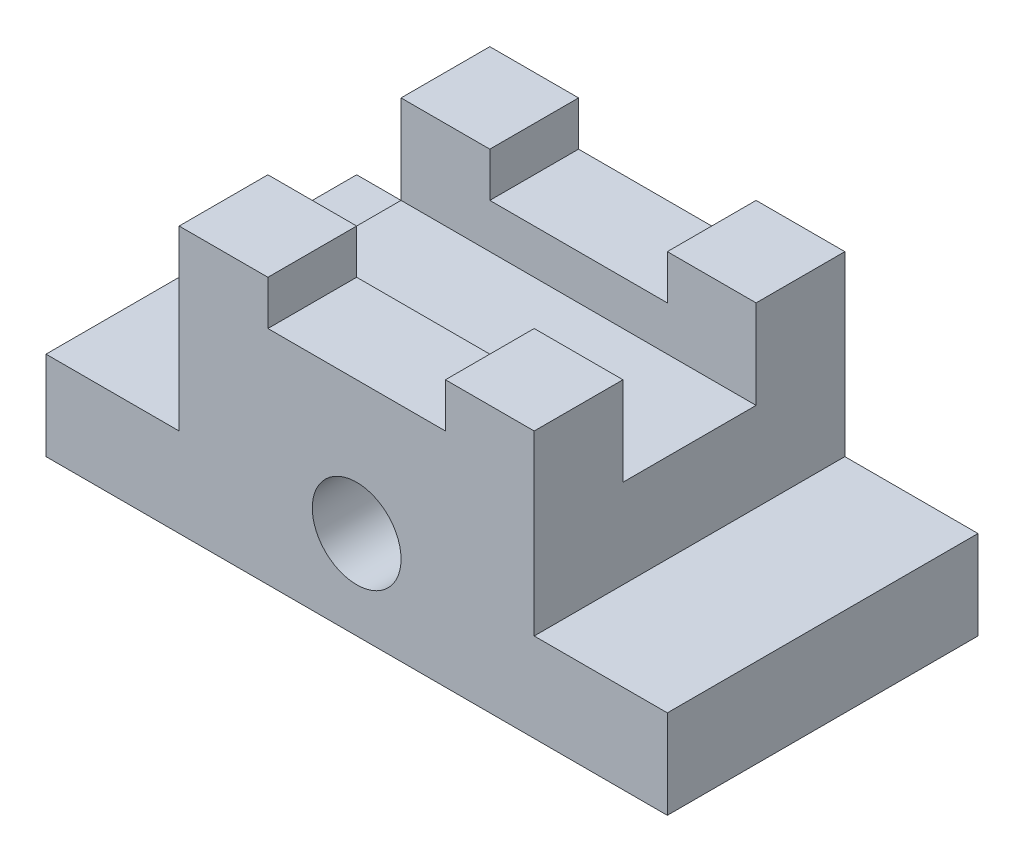
ISO-10303-21;
HEADER;
FILE_DESCRIPTION(('STEP AP214'),'2;1');
FILE_NAME('part.step','',(''),(''),'','','');
FILE_SCHEMA(('AUTOMOTIVE_DESIGN { 1 0 10303 214 1 1 1 1 }'));
ENDSEC;
DATA;
#1=APPLICATION_CONTEXT('core data for automotive mechanical design processes');
#2=APPLICATION_PROTOCOL_DEFINITION('international standard','automotive_design',2000,#1);
#3=PRODUCT_CONTEXT('',#1,'mechanical');
#4=PRODUCT('Part','Part','',(#3));
#5=PRODUCT_RELATED_PRODUCT_CATEGORY('part','',(#4));
#6=PRODUCT_DEFINITION_FORMATION('','',#4);
#7=PRODUCT_DEFINITION_CONTEXT('part definition',#1,'design');
#8=PRODUCT_DEFINITION('design','',#6,#7);
#9=PRODUCT_DEFINITION_SHAPE('','',#8);
#10=(LENGTH_UNIT() NAMED_UNIT(*) SI_UNIT(.MILLI.,.METRE.));
#11=(NAMED_UNIT(*) PLANE_ANGLE_UNIT() SI_UNIT($,.RADIAN.));
#12=(NAMED_UNIT(*) SI_UNIT($,.STERADIAN.) SOLID_ANGLE_UNIT());
#13=UNCERTAINTY_MEASURE_WITH_UNIT(LENGTH_MEASURE(1.E-05),#10,'distance_accuracy_value','');
#14=(GEOMETRIC_REPRESENTATION_CONTEXT(3) GLOBAL_UNCERTAINTY_ASSIGNED_CONTEXT((#13)) GLOBAL_UNIT_ASSIGNED_CONTEXT((#10,
#11,#12)) REPRESENTATION_CONTEXT('',''));
#15=CARTESIAN_POINT('',(0.,0.,0.));
#16=DIRECTION('',(0.,0.,1.));
#17=DIRECTION('',(1.,0.,0.));
#18=AXIS2_PLACEMENT_3D('',#15,#16,#17);
#19=CARTESIAN_POINT('',(0.,30.,0.));
#20=DIRECTION('',(0.,-1.,0.));
#21=DIRECTION('',(0.,0.,-1.));
#22=AXIS2_PLACEMENT_3D('',#19,#20,#21);
#23=PLANE('',#22);
#24=DIRECTION('',(1.,0.,0.));
#25=VECTOR('',#24,1.);
#26=CARTESIAN_POINT('',(14.,30.,-25.));
#27=LINE('',#26,#25);
#28=CARTESIAN_POINT('',(15.,30.,-25.));
#29=VERTEX_POINT('',#28);
#30=CARTESIAN_POINT('',(25.,30.,-25.));
#31=VERTEX_POINT('',#30);
#32=EDGE_CURVE('E266',#29,#31,#27,.T.);
#33=ORIENTED_EDGE('',*,*,#32,.T.);
#34=DIRECTION('',(0.,0.,1.));
#35=VECTOR('',#34,1.);
#36=CARTESIAN_POINT('',(25.,30.,-41.));
#37=LINE('',#36,#35);
#38=CARTESIAN_POINT('',(25.,30.,-35.));
#39=VERTEX_POINT('',#38);
#40=EDGE_CURVE('E208',#39,#31,#37,.T.);
#41=ORIENTED_EDGE('',*,*,#40,.F.);
#42=DIRECTION('',(-1.,0.,0.));
#43=VECTOR('',#42,1.);
#44=CARTESIAN_POINT('',(0.,30.,-35.));
#45=LINE('',#44,#43);
#46=CARTESIAN_POINT('',(15.,30.,-35.));
#47=VERTEX_POINT('',#46);
#48=EDGE_CURVE('E337',#39,#47,#45,.T.);
#49=ORIENTED_EDGE('',*,*,#48,.T.);
#50=DIRECTION('',(0.,0.,-1.));
#51=VECTOR('',#50,1.);
#52=CARTESIAN_POINT('',(15.,30.,0.));
#53=LINE('',#52,#51);
#54=EDGE_CURVE('E305',#29,#47,#53,.T.);
#55=ORIENTED_EDGE('',*,*,#54,.F.);
#56=EDGE_LOOP('',(#33,#41,#49,#55));
#57=FACE_BOUND('',#56,.T.);
#58=ADVANCED_FACE('F39',(#57),#23,.F.);
#59=DIRECTION('',(1.,0.,0.));
#60=VECTOR('',#59,1.);
#61=CARTESIAN_POINT('',(0.,30.,0.));
#62=LINE('',#61,#60);
#63=CARTESIAN_POINT('',(15.,30.,0.));
#64=VERTEX_POINT('',#63);
#65=CARTESIAN_POINT('',(25.,30.,0.));
#66=VERTEX_POINT('',#65);
#67=EDGE_CURVE('E334',#64,#66,#62,.T.);
#68=ORIENTED_EDGE('',*,*,#67,.T.);
#69=CARTESIAN_POINT('',(25.,30.,-10.));
#70=VERTEX_POINT('',#69);
#71=EDGE_CURVE('E191',#70,#66,#37,.T.);
#72=ORIENTED_EDGE('',*,*,#71,.F.);
#73=DIRECTION('',(1.,0.,0.));
#74=VECTOR('',#73,1.);
#75=CARTESIAN_POINT('',(14.,30.,-9.99999999999999));
#76=LINE('',#75,#74);
#77=CARTESIAN_POINT('',(15.,30.,-9.99999999999999));
#78=VERTEX_POINT('',#77);
#79=EDGE_CURVE('E261',#78,#70,#76,.T.);
#80=ORIENTED_EDGE('',*,*,#79,.F.);
#81=EDGE_CURVE('E312',#64,#78,#53,.T.);
#82=ORIENTED_EDGE('',*,*,#81,.F.);
#83=EDGE_LOOP('',(#68,#72,#80,#82));
#84=FACE_BOUND('',#83,.T.);
#85=ADVANCED_FACE('F440',(#84),#23,.F.);
#86=CARTESIAN_POINT('',(55.,30.,-35.));
#87=VERTEX_POINT('',#86);
#88=CARTESIAN_POINT('',(45.,30.,-35.));
#89=VERTEX_POINT('',#88);
#90=EDGE_CURVE('E339',#87,#89,#45,.T.);
#91=ORIENTED_EDGE('',*,*,#90,.T.);
#92=DIRECTION('',(0.,0.,1.));
#93=VECTOR('',#92,1.);
#94=CARTESIAN_POINT('',(45.,30.,-41.));
#95=LINE('',#94,#93);
#96=CARTESIAN_POINT('',(45.,30.,-25.));
#97=VERTEX_POINT('',#96);
#98=EDGE_CURVE('E209',#89,#97,#95,.T.);
#99=ORIENTED_EDGE('',*,*,#98,.T.);
#100=CARTESIAN_POINT('',(55.,30.,-25.));
#101=VERTEX_POINT('',#100);
#102=EDGE_CURVE('E253',#97,#101,#27,.T.);
#103=ORIENTED_EDGE('',*,*,#102,.T.);
#104=DIRECTION('',(0.,0.,1.));
#105=VECTOR('',#104,1.);
#106=CARTESIAN_POINT('',(55.,30.,-35.));
#107=LINE('',#106,#105);
#108=EDGE_CURVE('E286',#87,#101,#107,.T.);
#109=ORIENTED_EDGE('',*,*,#108,.F.);
#110=EDGE_LOOP('',(#91,#99,#103,#109));
#111=FACE_BOUND('',#110,.T.);
#112=ADVANCED_FACE('F399',(#111),#23,.F.);
#113=CARTESIAN_POINT('',(0.,30.,0.));
#114=DIRECTION('',(1.,0.,0.));
#115=DIRECTION('',(0.,0.,-1.));
#116=AXIS2_PLACEMENT_3D('',#113,#114,#115);
#117=PLANE('',#116);
#118=DIRECTION('',(0.,-1.,0.));
#119=VECTOR('',#118,1.);
#120=CARTESIAN_POINT('',(0.,30.,0.));
#121=LINE('',#120,#119);
#122=CARTESIAN_POINT('',(0.,10.,0.));
#123=VERTEX_POINT('',#122);
#124=CARTESIAN_POINT('',(0.,0.,0.));
#125=VERTEX_POINT('',#124);
#126=EDGE_CURVE('E367',#123,#125,#121,.T.);
#127=ORIENTED_EDGE('',*,*,#126,.F.);
#128=DIRECTION('',(0.,0.,1.));
#129=VECTOR('',#128,1.);
#130=CARTESIAN_POINT('',(0.,10.,0.));
#131=LINE('',#130,#129);
#132=CARTESIAN_POINT('',(0.,10.,-35.));
#133=VERTEX_POINT('',#132);
#134=EDGE_CURVE('E308',#133,#123,#131,.T.);
#135=ORIENTED_EDGE('',*,*,#134,.F.);
#136=DIRECTION('',(0.,-1.,0.));
#137=VECTOR('',#136,1.);
#138=CARTESIAN_POINT('',(0.,30.,-35.));
#139=LINE('',#138,#137);
#140=CARTESIAN_POINT('',(0.,0.,-35.));
#141=VERTEX_POINT('',#140);
#142=EDGE_CURVE('E343',#133,#141,#139,.T.);
#143=ORIENTED_EDGE('',*,*,#142,.T.);
#144=DIRECTION('',(0.,0.,1.));
#145=VECTOR('',#144,1.);
#146=CARTESIAN_POINT('',(0.,0.,0.));
#147=LINE('',#146,#145);
#148=EDGE_CURVE('E331',#141,#125,#147,.T.);
#149=ORIENTED_EDGE('',*,*,#148,.T.);
#150=EDGE_LOOP('',(#127,#135,#143,#149));
#151=FACE_BOUND('',#150,.T.);
#152=ADVANCED_FACE('F41',(#151),#117,.F.);
#153=CARTESIAN_POINT('',(0.,30.,0.));
#154=DIRECTION('',(0.,0.,-1.));
#155=DIRECTION('',(-1.,0.,0.));
#156=AXIS2_PLACEMENT_3D('',#153,#154,#155);
#157=PLANE('',#156);
#158=CARTESIAN_POINT('',(35.,10.,0.));
#159=DIRECTION('',(0.,0.,1.));
#160=DIRECTION('',(1.,0.,0.));
#161=AXIS2_PLACEMENT_3D('',#158,#159,#160);
#162=CIRCLE('',#161,5.);
#163=CARTESIAN_POINT('',(40.,10.,0.));
#164=VERTEX_POINT('',#163);
#165=EDGE_CURVE('E493',#164,#164,#162,.T.);
#166=ORIENTED_EDGE('',*,*,#165,.F.);
#167=EDGE_LOOP('',(#166));
#168=FACE_BOUND('',#167,.T.);
#169=DIRECTION('',(1.,0.,0.));
#170=VECTOR('',#169,1.);
#171=CARTESIAN_POINT('',(25.,25.,0.));
#172=LINE('',#171,#170);
#173=CARTESIAN_POINT('',(25.,25.,0.));
#174=VERTEX_POINT('',#173);
#175=CARTESIAN_POINT('',(45.,25.,0.));
#176=VERTEX_POINT('',#175);
#177=EDGE_CURVE('E179',#174,#176,#172,.T.);
#178=ORIENTED_EDGE('',*,*,#177,.F.);
#179=DIRECTION('',(0.,-1.,0.));
#180=VECTOR('',#179,1.);
#181=CARTESIAN_POINT('',(25.,30.,0.));
#182=LINE('',#181,#180);
#183=EDGE_CURVE('E188',#66,#174,#182,.T.);
#184=ORIENTED_EDGE('',*,*,#183,.F.);
#185=ORIENTED_EDGE('',*,*,#67,.F.);
#186=DIRECTION('',(0.,1.,0.));
#187=VECTOR('',#186,1.);
#188=CARTESIAN_POINT('',(15.,10.,0.));
#189=LINE('',#188,#187);
#190=CARTESIAN_POINT('',(15.,10.,0.));
#191=VERTEX_POINT('',#190);
#192=EDGE_CURVE('E323',#191,#64,#189,.T.);
#193=ORIENTED_EDGE('',*,*,#192,.F.);
#194=DIRECTION('',(1.,0.,0.));
#195=VECTOR('',#194,1.);
#196=CARTESIAN_POINT('',(0.,10.,0.));
#197=LINE('',#196,#195);
#198=EDGE_CURVE('E311',#123,#191,#197,.T.);
#199=ORIENTED_EDGE('',*,*,#198,.F.);
#200=ORIENTED_EDGE('',*,*,#126,.T.);
#201=DIRECTION('',(1.,0.,0.));
#202=VECTOR('',#201,1.);
#203=CARTESIAN_POINT('',(0.,0.,0.));
#204=LINE('',#203,#202);
#205=CARTESIAN_POINT('',(70.,0.,0.));
#206=VERTEX_POINT('',#205);
#207=EDGE_CURVE('E347',#125,#206,#204,.T.);
#208=ORIENTED_EDGE('',*,*,#207,.T.);
#209=DIRECTION('',(0.,-1.,0.));
#210=VECTOR('',#209,1.);
#211=CARTESIAN_POINT('',(70.,30.,0.));
#212=LINE('',#211,#210);
#213=CARTESIAN_POINT('',(70.,10.,0.));
#214=VERTEX_POINT('',#213);
#215=EDGE_CURVE('E364',#214,#206,#212,.T.);
#216=ORIENTED_EDGE('',*,*,#215,.F.);
#217=DIRECTION('',(1.,0.,0.));
#218=VECTOR('',#217,1.);
#219=CARTESIAN_POINT('',(70.,10.,0.));
#220=LINE('',#219,#218);
#221=CARTESIAN_POINT('',(55.,10.,0.));
#222=VERTEX_POINT('',#221);
#223=EDGE_CURVE('E294',#222,#214,#220,.T.);
#224=ORIENTED_EDGE('',*,*,#223,.F.);
#225=DIRECTION('',(0.,1.,0.));
#226=VECTOR('',#225,1.);
#227=CARTESIAN_POINT('',(55.,10.,0.));
#228=LINE('',#227,#226);
#229=CARTESIAN_POINT('',(55.,30.,0.));
#230=VERTEX_POINT('',#229);
#231=EDGE_CURVE('E301',#222,#230,#228,.T.);
#232=ORIENTED_EDGE('',*,*,#231,.T.);
#233=CARTESIAN_POINT('',(45.,30.,0.));
#234=VERTEX_POINT('',#233);
#235=EDGE_CURVE('E338',#234,#230,#62,.T.);
#236=ORIENTED_EDGE('',*,*,#235,.F.);
#237=DIRECTION('',(0.,1.,0.));
#238=VECTOR('',#237,1.);
#239=CARTESIAN_POINT('',(45.,30.,0.));
#240=LINE('',#239,#238);
#241=EDGE_CURVE('E185',#176,#234,#240,.T.);
#242=ORIENTED_EDGE('',*,*,#241,.F.);
#243=EDGE_LOOP('',(#178,#184,#185,#193,#199,#200,#208,#216,#224,#232,#236,#242));
#244=FACE_BOUND('',#243,.T.);
#245=ADVANCED_FACE('F198',(#168,#244),#157,.F.);
#246=CARTESIAN_POINT('',(70.,30.,0.));
#247=DIRECTION('',(-1.,0.,0.));
#248=DIRECTION('',(0.,0.,1.));
#249=AXIS2_PLACEMENT_3D('',#246,#247,#248);
#250=PLANE('',#249);
#251=DIRECTION('',(0.,-1.,0.));
#252=VECTOR('',#251,1.);
#253=CARTESIAN_POINT('',(70.,30.,-35.));
#254=LINE('',#253,#252);
#255=CARTESIAN_POINT('',(70.,10.,-35.));
#256=VERTEX_POINT('',#255);
#257=CARTESIAN_POINT('',(70.,0.,-35.));
#258=VERTEX_POINT('',#257);
#259=EDGE_CURVE('E361',#256,#258,#254,.T.);
#260=ORIENTED_EDGE('',*,*,#259,.F.);
#261=DIRECTION('',(0.,0.,-1.));
#262=VECTOR('',#261,1.);
#263=CARTESIAN_POINT('',(70.,10.,-35.));
#264=LINE('',#263,#262);
#265=EDGE_CURVE('E282',#214,#256,#264,.T.);
#266=ORIENTED_EDGE('',*,*,#265,.F.);
#267=ORIENTED_EDGE('',*,*,#215,.T.);
#268=DIRECTION('',(0.,0.,-1.));
#269=VECTOR('',#268,1.);
#270=CARTESIAN_POINT('',(70.,0.,0.));
#271=LINE('',#270,#269);
#272=EDGE_CURVE('E351',#206,#258,#271,.T.);
#273=ORIENTED_EDGE('',*,*,#272,.T.);
#274=EDGE_LOOP('',(#260,#266,#267,#273));
#275=FACE_BOUND('',#274,.T.);
#276=ADVANCED_FACE('F426',(#275),#250,.F.);
#277=CARTESIAN_POINT('',(0.,30.,-35.));
#278=DIRECTION('',(0.,0.,1.));
#279=DIRECTION('',(1.,0.,0.));
#280=AXIS2_PLACEMENT_3D('',#277,#278,#279);
#281=PLANE('',#280);
#282=CARTESIAN_POINT('',(35.,10.,-35.));
#283=DIRECTION('',(0.,0.,1.));
#284=DIRECTION('',(1.,0.,0.));
#285=AXIS2_PLACEMENT_3D('',#282,#283,#284);
#286=CIRCLE('',#285,5.);
#287=CARTESIAN_POINT('',(40.,10.,-35.));
#288=VERTEX_POINT('',#287);
#289=EDGE_CURVE('E196',#288,#288,#286,.T.);
#290=ORIENTED_EDGE('',*,*,#289,.T.);
#291=EDGE_LOOP('',(#290));
#292=FACE_BOUND('',#291,.T.);
#293=ORIENTED_EDGE('',*,*,#48,.F.);
#294=DIRECTION('',(0.,-1.,0.));
#295=VECTOR('',#294,1.);
#296=CARTESIAN_POINT('',(25.,30.,-35.));
#297=LINE('',#296,#295);
#298=CARTESIAN_POINT('',(25.,25.,-35.));
#299=VERTEX_POINT('',#298);
#300=EDGE_CURVE('E237',#39,#299,#297,.T.);
#301=ORIENTED_EDGE('',*,*,#300,.T.);
#302=DIRECTION('',(1.,0.,0.));
#303=VECTOR('',#302,1.);
#304=CARTESIAN_POINT('',(0.,25.,-35.));
#305=LINE('',#304,#303);
#306=CARTESIAN_POINT('',(45.,25.,-35.));
#307=VERTEX_POINT('',#306);
#308=EDGE_CURVE('E221',#299,#307,#305,.T.);
#309=ORIENTED_EDGE('',*,*,#308,.T.);
#310=DIRECTION('',(0.,1.,0.));
#311=VECTOR('',#310,1.);
#312=CARTESIAN_POINT('',(45.,30.0000000000001,-35.));
#313=LINE('',#312,#311);
#314=EDGE_CURVE('E229',#307,#89,#313,.T.);
#315=ORIENTED_EDGE('',*,*,#314,.T.);
#316=ORIENTED_EDGE('',*,*,#90,.F.);
#317=DIRECTION('',(0.,1.,0.));
#318=VECTOR('',#317,1.);
#319=CARTESIAN_POINT('',(55.,10.,-35.));
#320=LINE('',#319,#318);
#321=CARTESIAN_POINT('',(55.,10.,-35.));
#322=VERTEX_POINT('',#321);
#323=EDGE_CURVE('E297',#322,#87,#320,.T.);
#324=ORIENTED_EDGE('',*,*,#323,.F.);
#325=DIRECTION('',(-1.,0.,0.));
#326=VECTOR('',#325,1.);
#327=CARTESIAN_POINT('',(70.,10.,-35.));
#328=LINE('',#327,#326);
#329=EDGE_CURVE('E285',#256,#322,#328,.T.);
#330=ORIENTED_EDGE('',*,*,#329,.F.);
#331=ORIENTED_EDGE('',*,*,#259,.T.);
#332=DIRECTION('',(-1.,0.,0.));
#333=VECTOR('',#332,1.);
#334=CARTESIAN_POINT('',(0.,0.,-35.));
#335=LINE('',#334,#333);
#336=EDGE_CURVE('E355',#258,#141,#335,.T.);
#337=ORIENTED_EDGE('',*,*,#336,.T.);
#338=ORIENTED_EDGE('',*,*,#142,.F.);
#339=DIRECTION('',(-1.,0.,0.));
#340=VECTOR('',#339,1.);
#341=CARTESIAN_POINT('',(0.,10.,-35.));
#342=LINE('',#341,#340);
#343=CARTESIAN_POINT('',(15.,10.,-35.));
#344=VERTEX_POINT('',#343);
#345=EDGE_CURVE('E320',#344,#133,#342,.T.);
#346=ORIENTED_EDGE('',*,*,#345,.F.);
#347=DIRECTION('',(0.,1.,0.));
#348=VECTOR('',#347,1.);
#349=CARTESIAN_POINT('',(15.,10.,-35.));
#350=LINE('',#349,#348);
#351=EDGE_CURVE('E327',#344,#47,#350,.T.);
#352=ORIENTED_EDGE('',*,*,#351,.T.);
#353=EDGE_LOOP('',(#293,#301,#309,#315,#316,#324,#330,#331,#337,#338,#346,#352));
#354=FACE_BOUND('',#353,.T.);
#355=ADVANCED_FACE('F403',(#292,#354),#281,.F.);
#356=CARTESIAN_POINT('',(45.,30.,-10.));
#357=VERTEX_POINT('',#356);
#358=CARTESIAN_POINT('',(55.,30.,-9.99999999999999));
#359=VERTEX_POINT('',#358);
#360=EDGE_CURVE('E265',#357,#359,#76,.T.);
#361=ORIENTED_EDGE('',*,*,#360,.F.);
#362=EDGE_CURVE('E210',#357,#234,#95,.T.);
#363=ORIENTED_EDGE('',*,*,#362,.T.);
#364=ORIENTED_EDGE('',*,*,#235,.T.);
#365=EDGE_CURVE('E281',#359,#230,#107,.T.);
#366=ORIENTED_EDGE('',*,*,#365,.F.);
#367=EDGE_LOOP('',(#361,#363,#364,#366));
#368=FACE_BOUND('',#367,.T.);
#369=ADVANCED_FACE('F380',(#368),#23,.F.);
#370=CARTESIAN_POINT('',(0.,0.,0.));
#371=DIRECTION('',(0.,-1.,0.));
#372=DIRECTION('',(0.,0.,-1.));
#373=AXIS2_PLACEMENT_3D('',#370,#371,#372);
#374=PLANE('',#373);
#375=ORIENTED_EDGE('',*,*,#148,.F.);
#376=ORIENTED_EDGE('',*,*,#336,.F.);
#377=ORIENTED_EDGE('',*,*,#272,.F.);
#378=ORIENTED_EDGE('',*,*,#207,.F.);
#379=EDGE_LOOP('',(#375,#376,#377,#378));
#380=FACE_BOUND('',#379,.T.);
#381=ADVANCED_FACE('F448',(#380),#374,.T.);
#382=CARTESIAN_POINT('',(15.,10.,0.));
#383=DIRECTION('',(1.,0.,0.));
#384=DIRECTION('',(0.,0.,-1.));
#385=AXIS2_PLACEMENT_3D('',#382,#383,#384);
#386=PLANE('',#385);
#387=DIRECTION('',(0.,0.,-1.));
#388=VECTOR('',#387,1.);
#389=CARTESIAN_POINT('',(15.,20.,0.));
#390=LINE('',#389,#388);
#391=CARTESIAN_POINT('',(15.,20.,-9.99999999999999));
#392=VERTEX_POINT('',#391);
#393=CARTESIAN_POINT('',(15.,20.,-25.));
#394=VERTEX_POINT('',#393);
#395=EDGE_CURVE('E273',#392,#394,#390,.T.);
#396=ORIENTED_EDGE('',*,*,#395,.T.);
#397=DIRECTION('',(0.,1.,0.));
#398=VECTOR('',#397,1.);
#399=CARTESIAN_POINT('',(15.,10.,-25.));
#400=LINE('',#399,#398);
#401=EDGE_CURVE('E277',#394,#29,#400,.T.);
#402=ORIENTED_EDGE('',*,*,#401,.T.);
#403=ORIENTED_EDGE('',*,*,#54,.T.);
#404=ORIENTED_EDGE('',*,*,#351,.F.);
#405=DIRECTION('',(0.,0.,-1.));
#406=VECTOR('',#405,1.);
#407=CARTESIAN_POINT('',(15.,10.,0.));
#408=LINE('',#407,#406);
#409=EDGE_CURVE('E316',#191,#344,#408,.T.);
#410=ORIENTED_EDGE('',*,*,#409,.F.);
#411=ORIENTED_EDGE('',*,*,#192,.T.);
#412=ORIENTED_EDGE('',*,*,#81,.T.);
#413=DIRECTION('',(0.,-1.,0.));
#414=VECTOR('',#413,1.);
#415=CARTESIAN_POINT('',(15.,10.,-9.99999999999999));
#416=LINE('',#415,#414);
#417=EDGE_CURVE('E257',#78,#392,#416,.T.);
#418=ORIENTED_EDGE('',*,*,#417,.T.);
#419=EDGE_LOOP('',(#396,#402,#403,#404,#410,#411,#412,#418));
#420=FACE_BOUND('',#419,.T.);
#421=ADVANCED_FACE('F436',(#420),#386,.F.);
#422=CARTESIAN_POINT('',(0.,10.,0.));
#423=DIRECTION('',(0.,-1.,0.));
#424=DIRECTION('',(0.,0.,-1.));
#425=AXIS2_PLACEMENT_3D('',#422,#423,#424);
#426=PLANE('',#425);
#427=ORIENTED_EDGE('',*,*,#134,.T.);
#428=ORIENTED_EDGE('',*,*,#198,.T.);
#429=ORIENTED_EDGE('',*,*,#409,.T.);
#430=ORIENTED_EDGE('',*,*,#345,.T.);
#431=EDGE_LOOP('',(#427,#428,#429,#430));
#432=FACE_BOUND('',#431,.T.);
#433=ADVANCED_FACE('F455',(#432),#426,.F.);
#434=CARTESIAN_POINT('',(55.,10.,-35.));
#435=DIRECTION('',(-1.,0.,0.));
#436=DIRECTION('',(0.,0.,1.));
#437=AXIS2_PLACEMENT_3D('',#434,#435,#436);
#438=PLANE('',#437);
#439=ORIENTED_EDGE('',*,*,#108,.T.);
#440=DIRECTION('',(0.,1.,0.));
#441=VECTOR('',#440,1.);
#442=CARTESIAN_POINT('',(55.,30.,-25.));
#443=LINE('',#442,#441);
#444=CARTESIAN_POINT('',(55.,20.,-25.));
#445=VERTEX_POINT('',#444);
#446=EDGE_CURVE('E241',#445,#101,#443,.T.);
#447=ORIENTED_EDGE('',*,*,#446,.F.);
#448=DIRECTION('',(0.,0.,-1.));
#449=VECTOR('',#448,1.);
#450=CARTESIAN_POINT('',(55.,20.,-25.));
#451=LINE('',#450,#449);
#452=CARTESIAN_POINT('',(55.,20.,-10.));
#453=VERTEX_POINT('',#452);
#454=EDGE_CURVE('E249',#453,#445,#451,.T.);
#455=ORIENTED_EDGE('',*,*,#454,.F.);
#456=DIRECTION('',(0.,-1.,0.));
#457=VECTOR('',#456,1.);
#458=CARTESIAN_POINT('',(55.,30.,-10.));
#459=LINE('',#458,#457);
#460=EDGE_CURVE('E245',#359,#453,#459,.T.);
#461=ORIENTED_EDGE('',*,*,#460,.F.);
#462=ORIENTED_EDGE('',*,*,#365,.T.);
#463=ORIENTED_EDGE('',*,*,#231,.F.);
#464=DIRECTION('',(0.,0.,1.));
#465=VECTOR('',#464,1.);
#466=CARTESIAN_POINT('',(55.,10.,-35.));
#467=LINE('',#466,#465);
#468=EDGE_CURVE('E290',#322,#222,#467,.T.);
#469=ORIENTED_EDGE('',*,*,#468,.F.);
#470=ORIENTED_EDGE('',*,*,#323,.T.);
#471=EDGE_LOOP('',(#439,#447,#455,#461,#462,#463,#469,#470));
#472=FACE_BOUND('',#471,.T.);
#473=ADVANCED_FACE('F416',(#472),#438,.F.);
#474=CARTESIAN_POINT('',(0.,10.,0.));
#475=DIRECTION('',(0.,-1.,0.));
#476=DIRECTION('',(0.,0.,-1.));
#477=AXIS2_PLACEMENT_3D('',#474,#475,#476);
#478=PLANE('',#477);
#479=ORIENTED_EDGE('',*,*,#265,.T.);
#480=ORIENTED_EDGE('',*,*,#329,.T.);
#481=ORIENTED_EDGE('',*,*,#468,.T.);
#482=ORIENTED_EDGE('',*,*,#223,.T.);
#483=EDGE_LOOP('',(#479,#480,#481,#482));
#484=FACE_BOUND('',#483,.T.);
#485=ADVANCED_FACE('F422',(#484),#478,.F.);
#486=CARTESIAN_POINT('',(14.,30.,-25.));
#487=DIRECTION('',(0.,0.,-1.));
#488=DIRECTION('',(-1.,0.,0.));
#489=AXIS2_PLACEMENT_3D('',#486,#487,#488);
#490=PLANE('',#489);
#491=DIRECTION('',(-1.,0.,0.));
#492=VECTOR('',#491,1.);
#493=CARTESIAN_POINT('',(14.,25.,-25.));
#494=LINE('',#493,#492);
#495=CARTESIAN_POINT('',(45.,25.,-25.));
#496=VERTEX_POINT('',#495);
#497=CARTESIAN_POINT('',(25.,25.,-25.));
#498=VERTEX_POINT('',#497);
#499=EDGE_CURVE('E217',#496,#498,#494,.T.);
#500=ORIENTED_EDGE('',*,*,#499,.T.);
#501=DIRECTION('',(0.,1.,0.));
#502=VECTOR('',#501,1.);
#503=CARTESIAN_POINT('',(25.,30.,-25.));
#504=LINE('',#503,#502);
#505=EDGE_CURVE('E233',#498,#31,#504,.T.);
#506=ORIENTED_EDGE('',*,*,#505,.T.);
#507=ORIENTED_EDGE('',*,*,#32,.F.);
#508=ORIENTED_EDGE('',*,*,#401,.F.);
#509=DIRECTION('',(1.,0.,0.));
#510=VECTOR('',#509,1.);
#511=CARTESIAN_POINT('',(14.,20.,-25.));
#512=LINE('',#511,#510);
#513=EDGE_CURVE('E254',#394,#445,#512,.T.);
#514=ORIENTED_EDGE('',*,*,#513,.T.);
#515=ORIENTED_EDGE('',*,*,#446,.T.);
#516=ORIENTED_EDGE('',*,*,#102,.F.);
#517=DIRECTION('',(0.,-1.,0.));
#518=VECTOR('',#517,1.);
#519=CARTESIAN_POINT('',(45.,30.0000000000001,-25.));
#520=LINE('',#519,#518);
#521=EDGE_CURVE('E225',#97,#496,#520,.T.);
#522=ORIENTED_EDGE('',*,*,#521,.T.);
#523=EDGE_LOOP('',(#500,#506,#507,#508,#514,#515,#516,#522));
#524=FACE_BOUND('',#523,.T.);
#525=ADVANCED_FACE('F395',(#524),#490,.F.);
#526=CARTESIAN_POINT('',(14.,20.,-25.));
#527=DIRECTION('',(0.,-1.,0.));
#528=DIRECTION('',(0.,0.,-1.));
#529=AXIS2_PLACEMENT_3D('',#526,#527,#528);
#530=PLANE('',#529);
#531=DIRECTION('',(1.,0.,0.));
#532=VECTOR('',#531,1.);
#533=CARTESIAN_POINT('',(14.,20.,-9.99999999999999));
#534=LINE('',#533,#532);
#535=EDGE_CURVE('E258',#392,#453,#534,.T.);
#536=ORIENTED_EDGE('',*,*,#535,.T.);
#537=ORIENTED_EDGE('',*,*,#454,.T.);
#538=ORIENTED_EDGE('',*,*,#513,.F.);
#539=ORIENTED_EDGE('',*,*,#395,.F.);
#540=EDGE_LOOP('',(#536,#537,#538,#539));
#541=FACE_BOUND('',#540,.T.);
#542=ADVANCED_FACE('F433',(#541),#530,.F.);
#543=CARTESIAN_POINT('',(14.,30.,-9.99999999999999));
#544=DIRECTION('',(0.,0.,1.));
#545=DIRECTION('',(1.,0.,0.));
#546=AXIS2_PLACEMENT_3D('',#543,#544,#545);
#547=PLANE('',#546);
#548=ORIENTED_EDGE('',*,*,#79,.T.);
#549=DIRECTION('',(0.,-1.,0.));
#550=VECTOR('',#549,1.);
#551=CARTESIAN_POINT('',(25.,30.,-9.99999999999999));
#552=LINE('',#551,#550);
#553=CARTESIAN_POINT('',(25.,25.,-10.));
#554=VERTEX_POINT('',#553);
#555=EDGE_CURVE('E11',#70,#554,#552,.T.);
#556=ORIENTED_EDGE('',*,*,#555,.T.);
#557=DIRECTION('',(1.,0.,0.));
#558=VECTOR('',#557,1.);
#559=CARTESIAN_POINT('',(14.,25.,-9.99999999999999));
#560=LINE('',#559,#558);
#561=CARTESIAN_POINT('',(45.,25.,-9.99999999999999));
#562=VERTEX_POINT('',#561);
#563=EDGE_CURVE('E182',#554,#562,#560,.T.);
#564=ORIENTED_EDGE('',*,*,#563,.T.);
#565=DIRECTION('',(0.,1.,0.));
#566=VECTOR('',#565,1.);
#567=CARTESIAN_POINT('',(45.,30.,-9.99999999999999));
#568=LINE('',#567,#566);
#569=EDGE_CURVE('E48',#562,#357,#568,.T.);
#570=ORIENTED_EDGE('',*,*,#569,.T.);
#571=ORIENTED_EDGE('',*,*,#360,.T.);
#572=ORIENTED_EDGE('',*,*,#460,.T.);
#573=ORIENTED_EDGE('',*,*,#535,.F.);
#574=ORIENTED_EDGE('',*,*,#417,.F.);
#575=EDGE_LOOP('',(#548,#556,#564,#570,#571,#572,#573,#574));
#576=FACE_BOUND('',#575,.T.);
#577=ADVANCED_FACE('F375',(#576),#547,.F.);
#578=CARTESIAN_POINT('',(25.,25.,-41.));
#579=DIRECTION('',(0.,-1.,0.));
#580=DIRECTION('',(0.,0.,-1.));
#581=AXIS2_PLACEMENT_3D('',#578,#579,#580);
#582=PLANE('',#581);
#583=DIRECTION('',(0.,0.,1.));
#584=VECTOR('',#583,1.);
#585=CARTESIAN_POINT('',(25.,25.,-41.));
#586=LINE('',#585,#584);
#587=EDGE_CURVE('E175',#554,#174,#586,.T.);
#588=ORIENTED_EDGE('',*,*,#587,.T.);
#589=ORIENTED_EDGE('',*,*,#177,.T.);
#590=DIRECTION('',(0.,0.,1.));
#591=VECTOR('',#590,1.);
#592=CARTESIAN_POINT('',(45.,25.,-41.));
#593=LINE('',#592,#591);
#594=EDGE_CURVE('E63',#562,#176,#593,.T.);
#595=ORIENTED_EDGE('',*,*,#594,.F.);
#596=ORIENTED_EDGE('',*,*,#563,.F.);
#597=EDGE_LOOP('',(#588,#589,#595,#596));
#598=FACE_BOUND('',#597,.T.);
#599=ADVANCED_FACE('F177',(#598),#582,.F.);
#600=CARTESIAN_POINT('',(45.,30.,-41.));
#601=DIRECTION('',(1.,0.,0.));
#602=DIRECTION('',(0.,1.,0.));
#603=AXIS2_PLACEMENT_3D('',#600,#601,#602);
#604=PLANE('',#603);
#605=ORIENTED_EDGE('',*,*,#594,.T.);
#606=ORIENTED_EDGE('',*,*,#241,.T.);
#607=ORIENTED_EDGE('',*,*,#362,.F.);
#608=ORIENTED_EDGE('',*,*,#569,.F.);
#609=EDGE_LOOP('',(#605,#606,#607,#608));
#610=FACE_BOUND('',#609,.T.);
#611=ADVANCED_FACE('F483',(#610),#604,.F.);
#612=CARTESIAN_POINT('',(25.,30.,-41.));
#613=DIRECTION('',(-1.,0.,0.));
#614=DIRECTION('',(0.,0.,1.));
#615=AXIS2_PLACEMENT_3D('',#612,#613,#614);
#616=PLANE('',#615);
#617=ORIENTED_EDGE('',*,*,#71,.T.);
#618=ORIENTED_EDGE('',*,*,#183,.T.);
#619=ORIENTED_EDGE('',*,*,#587,.F.);
#620=ORIENTED_EDGE('',*,*,#555,.F.);
#621=EDGE_LOOP('',(#617,#618,#619,#620));
#622=FACE_BOUND('',#621,.T.);
#623=ADVANCED_FACE('F189',(#622),#616,.F.);
#624=ORIENTED_EDGE('',*,*,#40,.T.);
#625=ORIENTED_EDGE('',*,*,#505,.F.);
#626=EDGE_CURVE('E55',#299,#498,#586,.T.);
#627=ORIENTED_EDGE('',*,*,#626,.F.);
#628=ORIENTED_EDGE('',*,*,#300,.F.);
#629=EDGE_LOOP('',(#624,#625,#627,#628));
#630=FACE_BOUND('',#629,.T.);
#631=ADVANCED_FACE('F407',(#630),#616,.F.);
#632=EDGE_CURVE('E214',#307,#496,#593,.T.);
#633=ORIENTED_EDGE('',*,*,#632,.T.);
#634=ORIENTED_EDGE('',*,*,#521,.F.);
#635=ORIENTED_EDGE('',*,*,#98,.F.);
#636=ORIENTED_EDGE('',*,*,#314,.F.);
#637=EDGE_LOOP('',(#633,#634,#635,#636));
#638=FACE_BOUND('',#637,.T.);
#639=ADVANCED_FACE('F392',(#638),#604,.F.);
#640=ORIENTED_EDGE('',*,*,#626,.T.);
#641=ORIENTED_EDGE('',*,*,#499,.F.);
#642=ORIENTED_EDGE('',*,*,#632,.F.);
#643=ORIENTED_EDGE('',*,*,#308,.F.);
#644=EDGE_LOOP('',(#640,#641,#642,#643));
#645=FACE_BOUND('',#644,.T.);
#646=ADVANCED_FACE('F405',(#645),#582,.F.);
#647=CARTESIAN_POINT('',(35.,10.,-35.));
#648=DIRECTION('',(0.,0.,1.));
#649=DIRECTION('',(1.,0.,0.));
#650=AXIS2_PLACEMENT_3D('',#647,#648,#649);
#651=CYLINDRICAL_SURFACE('',#650,5.);
#652=ORIENTED_EDGE('',*,*,#289,.F.);
#653=EDGE_LOOP('',(#652));
#654=FACE_BOUND('',#653,.T.);
#655=ORIENTED_EDGE('',*,*,#165,.T.);
#656=EDGE_LOOP('',(#655));
#657=FACE_BOUND('',#656,.T.);
#658=ADVANCED_FACE('F480',(#654,#657),#651,.F.);
#659=CLOSED_SHELL('',(#58,#85,#112,#152,#245,#276,#355,#369,#381,#421,#433,#473,#485,#525,#542,
#577,#599,#611,#623,#631,#639,#646,#658));
#660=MANIFOLD_SOLID_BREP('B2',#659);
#661=ADVANCED_BREP_SHAPE_REPRESENTATION('',(#18,#660),#14);
#662=SHAPE_DEFINITION_REPRESENTATION(#9,#661);
ENDSEC;
END-ISO-10303-21;
